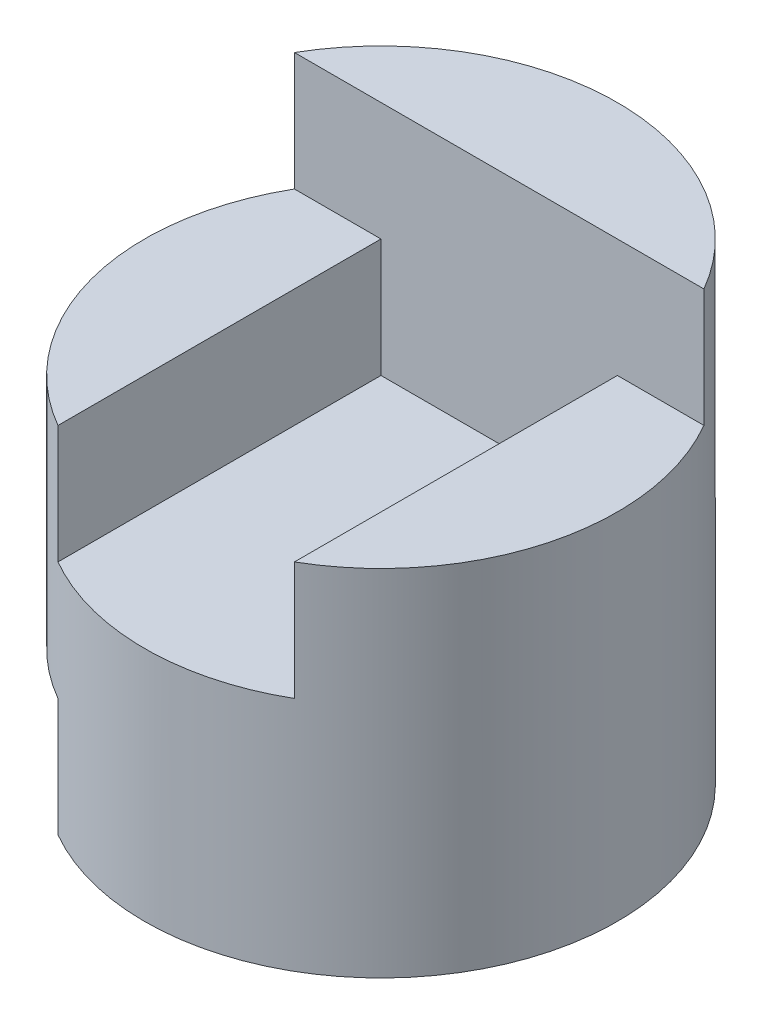
ISO-10303-21;
HEADER;
FILE_DESCRIPTION(('STEP AP214'),'2;1');
FILE_NAME('part.step','',(''),(''),'','','');
FILE_SCHEMA(('AUTOMOTIVE_DESIGN { 1 0 10303 214 1 1 1 1 }'));
ENDSEC;
DATA;
#1=APPLICATION_CONTEXT('core data for automotive mechanical design processes');
#2=APPLICATION_PROTOCOL_DEFINITION('international standard','automotive_design',2000,#1);
#3=PRODUCT_CONTEXT('',#1,'mechanical');
#4=PRODUCT('Part','Part','',(#3));
#5=PRODUCT_RELATED_PRODUCT_CATEGORY('part','',(#4));
#6=PRODUCT_DEFINITION_FORMATION('','',#4);
#7=PRODUCT_DEFINITION_CONTEXT('part definition',#1,'design');
#8=PRODUCT_DEFINITION('design','',#6,#7);
#9=PRODUCT_DEFINITION_SHAPE('','',#8);
#10=(LENGTH_UNIT() NAMED_UNIT(*) SI_UNIT(.MILLI.,.METRE.));
#11=(NAMED_UNIT(*) PLANE_ANGLE_UNIT() SI_UNIT($,.RADIAN.));
#12=(NAMED_UNIT(*) SI_UNIT($,.STERADIAN.) SOLID_ANGLE_UNIT());
#13=UNCERTAINTY_MEASURE_WITH_UNIT(LENGTH_MEASURE(1.E-05),#10,'distance_accuracy_value','');
#14=(GEOMETRIC_REPRESENTATION_CONTEXT(3) GLOBAL_UNCERTAINTY_ASSIGNED_CONTEXT((#13)) GLOBAL_UNIT_ASSIGNED_CONTEXT((#10,
#11,#12)) REPRESENTATION_CONTEXT('',''));
#15=CARTESIAN_POINT('',(0.,0.,0.));
#16=DIRECTION('',(0.,0.,1.));
#17=DIRECTION('',(1.,0.,0.));
#18=AXIS2_PLACEMENT_3D('',#15,#16,#17);
#19=CARTESIAN_POINT('',(0.,4.,0.));
#20=DIRECTION('',(0.,-1.,0.));
#21=DIRECTION('',(0.,0.,-1.));
#22=AXIS2_PLACEMENT_3D('',#19,#20,#21);
#23=CYLINDRICAL_SURFACE('',#22,2.);
#24=CARTESIAN_POINT('',(0.,1.,0.));
#25=DIRECTION('',(0.,-1.,0.));
#26=DIRECTION('',(0.,0.,1.));
#27=AXIS2_PLACEMENT_3D('',#24,#25,#26);
#28=CIRCLE('',#27,2.00000000000001);
#29=CARTESIAN_POINT('',(-1.,1.,1.73205080756888));
#30=VERTEX_POINT('',#29);
#31=CARTESIAN_POINT('',(-1.73205080756888,1.,-1.));
#32=VERTEX_POINT('',#31);
#33=EDGE_CURVE('E110',#30,#32,#28,.T.);
#34=ORIENTED_EDGE('',*,*,#33,.F.);
#35=DIRECTION('',(0.,-1.,0.));
#36=VECTOR('',#35,1.);
#37=CARTESIAN_POINT('',(-1.,1.,1.73205080756888));
#38=LINE('',#37,#36);
#39=CARTESIAN_POINT('',(-1.,0.,1.73205080756888));
#40=VERTEX_POINT('',#39);
#41=EDGE_CURVE('E123',#30,#40,#38,.T.);
#42=ORIENTED_EDGE('',*,*,#41,.T.);
#43=CARTESIAN_POINT('',(0.,0.,0.));
#44=DIRECTION('',(0.,1.,0.));
#45=DIRECTION('',(0.,0.,1.));
#46=AXIS2_PLACEMENT_3D('',#43,#44,#45);
#47=CIRCLE('',#46,2.);
#48=CARTESIAN_POINT('',(-1.73205080756888,0.,-1.));
#49=VERTEX_POINT('',#48);
#50=EDGE_CURVE('E121',#40,#49,#47,.T.);
#51=ORIENTED_EDGE('',*,*,#50,.T.);
#52=DIRECTION('',(0.,-1.,0.));
#53=VECTOR('',#52,1.);
#54=CARTESIAN_POINT('',(-1.73205080756888,1.,-1.));
#55=LINE('',#54,#53);
#56=EDGE_CURVE('E47',#32,#49,#55,.T.);
#57=ORIENTED_EDGE('',*,*,#56,.F.);
#58=EDGE_LOOP('',(#34,#42,#51,#57));
#59=FACE_BOUND('',#58,.T.);
#60=DIRECTION('',(0.,-1.,0.));
#61=VECTOR('',#60,1.);
#62=CARTESIAN_POINT('',(1.73205080756888,4.,-1.));
#63=LINE('',#62,#61);
#64=CARTESIAN_POINT('',(1.73205080756888,4.,-1.));
#65=VERTEX_POINT('',#64);
#66=CARTESIAN_POINT('',(1.73205080756888,3.,-1.));
#67=VERTEX_POINT('',#66);
#68=EDGE_CURVE('E55',#65,#67,#63,.T.);
#69=ORIENTED_EDGE('',*,*,#68,.T.);
#70=CARTESIAN_POINT('',(0.,3.,0.));
#71=DIRECTION('',(0.,1.,0.));
#72=DIRECTION('',(0.,0.,1.));
#73=AXIS2_PLACEMENT_3D('',#70,#71,#72);
#74=CIRCLE('',#73,2.);
#75=CARTESIAN_POINT('',(1.,3.,1.73205080756888));
#76=VERTEX_POINT('',#75);
#77=EDGE_CURVE('E11',#76,#67,#74,.T.);
#78=ORIENTED_EDGE('',*,*,#77,.F.);
#79=DIRECTION('',(0.,-1.,0.));
#80=VECTOR('',#79,1.);
#81=CARTESIAN_POINT('',(1.,4.,1.73205080756888));
#82=LINE('',#81,#80);
#83=CARTESIAN_POINT('',(1.,2.,1.73205080756888));
#84=VERTEX_POINT('',#83);
#85=EDGE_CURVE('E40',#84,#76,#82,.F.);
#86=ORIENTED_EDGE('',*,*,#85,.F.);
#87=CARTESIAN_POINT('',(0.,2.,0.));
#88=DIRECTION('',(0.,1.,0.));
#89=DIRECTION('',(-1.,0.,0.));
#90=AXIS2_PLACEMENT_3D('',#87,#88,#89);
#91=CIRCLE('',#90,2.);
#92=CARTESIAN_POINT('',(-1.,2.,1.73205080756888));
#93=VERTEX_POINT('',#92);
#94=EDGE_CURVE('E164',#93,#84,#91,.T.);
#95=ORIENTED_EDGE('',*,*,#94,.F.);
#96=DIRECTION('',(0.,-1.,0.));
#97=VECTOR('',#96,1.);
#98=CARTESIAN_POINT('',(-1.,4.,1.73205080756888));
#99=LINE('',#98,#97);
#100=CARTESIAN_POINT('',(-1.,3.,1.73205080756888));
#101=VERTEX_POINT('',#100);
#102=EDGE_CURVE('E162',#101,#93,#99,.T.);
#103=ORIENTED_EDGE('',*,*,#102,.F.);
#104=CARTESIAN_POINT('',(0.,3.,0.));
#105=DIRECTION('',(0.,1.,0.));
#106=DIRECTION('',(-1.,0.,0.));
#107=AXIS2_PLACEMENT_3D('',#104,#105,#106);
#108=CIRCLE('',#107,2.);
#109=CARTESIAN_POINT('',(-1.73205080756888,3.,-1.));
#110=VERTEX_POINT('',#109);
#111=EDGE_CURVE('E160',#110,#101,#108,.T.);
#112=ORIENTED_EDGE('',*,*,#111,.F.);
#113=DIRECTION('',(0.,-1.,0.));
#114=VECTOR('',#113,1.);
#115=CARTESIAN_POINT('',(-1.73205080756888,4.,-1.));
#116=LINE('',#115,#114);
#117=CARTESIAN_POINT('',(-1.73205080756888,4.,-1.));
#118=VERTEX_POINT('',#117);
#119=EDGE_CURVE('E150',#110,#118,#116,.F.);
#120=ORIENTED_EDGE('',*,*,#119,.T.);
#121=CARTESIAN_POINT('',(0.,4.,0.));
#122=DIRECTION('',(0.,1.,0.));
#123=DIRECTION('',(0.,0.,1.));
#124=AXIS2_PLACEMENT_3D('',#121,#122,#123);
#125=CIRCLE('',#124,2.);
#126=EDGE_CURVE('E154',#65,#118,#125,.T.);
#127=ORIENTED_EDGE('',*,*,#126,.F.);
#128=EDGE_LOOP('',(#69,#78,#86,#95,#103,#112,#120,#127));
#129=FACE_BOUND('',#128,.T.);
#130=ADVANCED_FACE('F33',(#59,#129),#23,.T.);
#131=CARTESIAN_POINT('',(0.,4.,0.));
#132=DIRECTION('',(0.,1.,0.));
#133=DIRECTION('',(0.,0.,1.));
#134=AXIS2_PLACEMENT_3D('',#131,#132,#133);
#135=PLANE('',#134);
#136=DIRECTION('',(-1.,0.,0.));
#137=VECTOR('',#136,1.);
#138=CARTESIAN_POINT('',(0.,4.,-1.));
#139=LINE('',#138,#137);
#140=EDGE_CURVE('E157',#65,#118,#139,.T.);
#141=ORIENTED_EDGE('',*,*,#140,.F.);
#142=ORIENTED_EDGE('',*,*,#126,.T.);
#143=EDGE_LOOP('',(#141,#142));
#144=FACE_BOUND('',#143,.T.);
#145=ADVANCED_FACE('F179',(#144),#135,.T.);
#146=CARTESIAN_POINT('',(0.,0.,0.));
#147=DIRECTION('',(0.,1.,0.));
#148=DIRECTION('',(0.,0.,1.));
#149=AXIS2_PLACEMENT_3D('',#146,#147,#148);
#150=PLANE('',#149);
#151=ORIENTED_EDGE('',*,*,#50,.F.);
#152=DIRECTION('',(0.,0.,1.));
#153=VECTOR('',#152,1.);
#154=CARTESIAN_POINT('',(-1.,0.,1.73205080756888));
#155=LINE('',#154,#153);
#156=CARTESIAN_POINT('',(-1.,0.,-1.));
#157=VERTEX_POINT('',#156);
#158=EDGE_CURVE('E116',#157,#40,#155,.T.);
#159=ORIENTED_EDGE('',*,*,#158,.F.);
#160=DIRECTION('',(1.,0.,0.));
#161=VECTOR('',#160,1.);
#162=CARTESIAN_POINT('',(-1.,0.,-1.));
#163=LINE('',#162,#161);
#164=EDGE_CURVE('E287',#49,#157,#163,.T.);
#165=ORIENTED_EDGE('',*,*,#164,.F.);
#166=EDGE_LOOP('',(#151,#159,#165));
#167=FACE_BOUND('',#166,.T.);
#168=ADVANCED_FACE('F205',(#167),#150,.F.);
#169=CARTESIAN_POINT('',(-1.,3.,3.));
#170=DIRECTION('',(0.,1.,0.));
#171=DIRECTION('',(-1.,0.,0.));
#172=AXIS2_PLACEMENT_3D('',#169,#170,#171);
#173=PLANE('',#172);
#174=ORIENTED_EDGE('',*,*,#111,.T.);
#175=DIRECTION('',(0.,0.,-1.));
#176=VECTOR('',#175,1.);
#177=CARTESIAN_POINT('',(-1.,3.,3.));
#178=LINE('',#177,#176);
#179=CARTESIAN_POINT('',(-1.,3.,-1.));
#180=VERTEX_POINT('',#179);
#181=EDGE_CURVE('E148',#101,#180,#178,.T.);
#182=ORIENTED_EDGE('',*,*,#181,.T.);
#183=DIRECTION('',(1.,0.,0.));
#184=VECTOR('',#183,1.);
#185=CARTESIAN_POINT('',(-1.,3.,-1.));
#186=LINE('',#185,#184);
#187=EDGE_CURVE('E128',#110,#180,#186,.T.);
#188=ORIENTED_EDGE('',*,*,#187,.F.);
#189=EDGE_LOOP('',(#174,#182,#188));
#190=FACE_BOUND('',#189,.T.);
#191=ADVANCED_FACE('F184',(#190),#173,.T.);
#192=CARTESIAN_POINT('',(-1.,2.,3.));
#193=DIRECTION('',(1.,0.,0.));
#194=DIRECTION('',(0.,0.,-1.));
#195=AXIS2_PLACEMENT_3D('',#192,#193,#194);
#196=PLANE('',#195);
#197=ORIENTED_EDGE('',*,*,#102,.T.);
#198=DIRECTION('',(0.,0.,-1.));
#199=VECTOR('',#198,1.);
#200=CARTESIAN_POINT('',(-1.,2.,3.));
#201=LINE('',#200,#199);
#202=CARTESIAN_POINT('',(-1.,2.,-1.));
#203=VERTEX_POINT('',#202);
#204=EDGE_CURVE('E146',#93,#203,#201,.T.);
#205=ORIENTED_EDGE('',*,*,#204,.T.);
#206=DIRECTION('',(0.,-1.,0.));
#207=VECTOR('',#206,1.);
#208=CARTESIAN_POINT('',(-1.,2.,-1.));
#209=LINE('',#208,#207);
#210=EDGE_CURVE('E131',#180,#203,#209,.T.);
#211=ORIENTED_EDGE('',*,*,#210,.F.);
#212=ORIENTED_EDGE('',*,*,#181,.F.);
#213=EDGE_LOOP('',(#197,#205,#211,#212));
#214=FACE_BOUND('',#213,.T.);
#215=ADVANCED_FACE('F189',(#214),#196,.T.);
#216=CARTESIAN_POINT('',(1.,2.,3.));
#217=DIRECTION('',(0.,1.,0.));
#218=DIRECTION('',(-1.,0.,0.));
#219=AXIS2_PLACEMENT_3D('',#216,#217,#218);
#220=PLANE('',#219);
#221=ORIENTED_EDGE('',*,*,#94,.T.);
#222=DIRECTION('',(0.,0.,-1.));
#223=VECTOR('',#222,1.);
#224=CARTESIAN_POINT('',(1.,2.,3.));
#225=LINE('',#224,#223);
#226=CARTESIAN_POINT('',(1.,2.,-1.));
#227=VERTEX_POINT('',#226);
#228=EDGE_CURVE('E144',#84,#227,#225,.T.);
#229=ORIENTED_EDGE('',*,*,#228,.T.);
#230=DIRECTION('',(1.,0.,0.));
#231=VECTOR('',#230,1.);
#232=CARTESIAN_POINT('',(1.,2.,-1.));
#233=LINE('',#232,#231);
#234=EDGE_CURVE('E134',#203,#227,#233,.T.);
#235=ORIENTED_EDGE('',*,*,#234,.F.);
#236=ORIENTED_EDGE('',*,*,#204,.F.);
#237=EDGE_LOOP('',(#221,#229,#235,#236));
#238=FACE_BOUND('',#237,.T.);
#239=ADVANCED_FACE('F192',(#238),#220,.T.);
#240=CARTESIAN_POINT('',(1.,3.,3.));
#241=DIRECTION('',(-1.,0.,0.));
#242=DIRECTION('',(0.,-1.,0.));
#243=AXIS2_PLACEMENT_3D('',#240,#241,#242);
#244=PLANE('',#243);
#245=ORIENTED_EDGE('',*,*,#85,.T.);
#246=DIRECTION('',(0.,0.,-1.));
#247=VECTOR('',#246,1.);
#248=CARTESIAN_POINT('',(1.,3.,3.));
#249=LINE('',#248,#247);
#250=CARTESIAN_POINT('',(1.,3.,-1.));
#251=VERTEX_POINT('',#250);
#252=EDGE_CURVE('E142',#76,#251,#249,.T.);
#253=ORIENTED_EDGE('',*,*,#252,.T.);
#254=DIRECTION('',(0.,1.,0.));
#255=VECTOR('',#254,1.);
#256=CARTESIAN_POINT('',(1.,3.,-1.));
#257=LINE('',#256,#255);
#258=EDGE_CURVE('E137',#227,#251,#257,.T.);
#259=ORIENTED_EDGE('',*,*,#258,.F.);
#260=ORIENTED_EDGE('',*,*,#228,.F.);
#261=EDGE_LOOP('',(#245,#253,#259,#260));
#262=FACE_BOUND('',#261,.T.);
#263=ADVANCED_FACE('F169',(#262),#244,.T.);
#264=CARTESIAN_POINT('',(2.,3.,3.));
#265=DIRECTION('',(0.,1.,0.));
#266=DIRECTION('',(0.,0.,1.));
#267=AXIS2_PLACEMENT_3D('',#264,#265,#266);
#268=PLANE('',#267);
#269=ORIENTED_EDGE('',*,*,#77,.T.);
#270=DIRECTION('',(1.,0.,0.));
#271=VECTOR('',#270,1.);
#272=CARTESIAN_POINT('',(2.,3.,-1.));
#273=LINE('',#272,#271);
#274=EDGE_CURVE('E140',#251,#67,#273,.T.);
#275=ORIENTED_EDGE('',*,*,#274,.F.);
#276=ORIENTED_EDGE('',*,*,#252,.F.);
#277=EDGE_LOOP('',(#269,#275,#276));
#278=FACE_BOUND('',#277,.T.);
#279=ADVANCED_FACE('F175',(#278),#268,.T.);
#280=CARTESIAN_POINT('',(0.,0.,-1.));
#281=DIRECTION('',(0.,0.,-1.));
#282=DIRECTION('',(-1.,0.,0.));
#283=AXIS2_PLACEMENT_3D('',#280,#281,#282);
#284=PLANE('',#283);
#285=ORIENTED_EDGE('',*,*,#140,.T.);
#286=ORIENTED_EDGE('',*,*,#119,.F.);
#287=ORIENTED_EDGE('',*,*,#187,.T.);
#288=ORIENTED_EDGE('',*,*,#210,.T.);
#289=ORIENTED_EDGE('',*,*,#234,.T.);
#290=ORIENTED_EDGE('',*,*,#258,.T.);
#291=ORIENTED_EDGE('',*,*,#274,.T.);
#292=ORIENTED_EDGE('',*,*,#68,.F.);
#293=EDGE_LOOP('',(#285,#286,#287,#288,#289,#290,#291,#292));
#294=FACE_BOUND('',#293,.T.);
#295=ADVANCED_FACE('F180',(#294),#284,.F.);
#296=CARTESIAN_POINT('',(-1.,1.,1.73205080756888));
#297=DIRECTION('',(1.,0.,0.));
#298=DIRECTION('',(0.,0.,-1.));
#299=AXIS2_PLACEMENT_3D('',#296,#297,#298);
#300=PLANE('',#299);
#301=ORIENTED_EDGE('',*,*,#158,.T.);
#302=ORIENTED_EDGE('',*,*,#41,.F.);
#303=DIRECTION('',(0.,0.,1.));
#304=VECTOR('',#303,1.);
#305=CARTESIAN_POINT('',(-1.,1.,1.73205080756888));
#306=LINE('',#305,#304);
#307=CARTESIAN_POINT('',(-1.,1.,-1.));
#308=VERTEX_POINT('',#307);
#309=EDGE_CURVE('E109',#308,#30,#306,.T.);
#310=ORIENTED_EDGE('',*,*,#309,.F.);
#311=DIRECTION('',(0.,-1.,0.));
#312=VECTOR('',#311,1.);
#313=CARTESIAN_POINT('',(-1.,1.,-1.));
#314=LINE('',#313,#312);
#315=EDGE_CURVE('E105',#308,#157,#314,.T.);
#316=ORIENTED_EDGE('',*,*,#315,.T.);
#317=EDGE_LOOP('',(#301,#302,#310,#316));
#318=FACE_BOUND('',#317,.T.);
#319=ADVANCED_FACE('F247',(#318),#300,.F.);
#320=CARTESIAN_POINT('',(-1.,1.,-1.));
#321=DIRECTION('',(0.,0.,-1.));
#322=DIRECTION('',(-1.,0.,0.));
#323=AXIS2_PLACEMENT_3D('',#320,#321,#322);
#324=PLANE('',#323);
#325=ORIENTED_EDGE('',*,*,#164,.T.);
#326=ORIENTED_EDGE('',*,*,#315,.F.);
#327=DIRECTION('',(1.,0.,0.));
#328=VECTOR('',#327,1.);
#329=CARTESIAN_POINT('',(-1.,1.,-1.));
#330=LINE('',#329,#328);
#331=EDGE_CURVE('E102',#32,#308,#330,.T.);
#332=ORIENTED_EDGE('',*,*,#331,.F.);
#333=ORIENTED_EDGE('',*,*,#56,.T.);
#334=EDGE_LOOP('',(#325,#326,#332,#333));
#335=FACE_BOUND('',#334,.T.);
#336=ADVANCED_FACE('F104',(#335),#324,.F.);
#337=CARTESIAN_POINT('',(0.,1.,0.));
#338=DIRECTION('',(0.,1.,0.));
#339=DIRECTION('',(0.,0.,1.));
#340=AXIS2_PLACEMENT_3D('',#337,#338,#339);
#341=PLANE('',#340);
#342=ORIENTED_EDGE('',*,*,#33,.T.);
#343=ORIENTED_EDGE('',*,*,#331,.T.);
#344=ORIENTED_EDGE('',*,*,#309,.T.);
#345=EDGE_LOOP('',(#342,#343,#344));
#346=FACE_BOUND('',#345,.T.);
#347=ADVANCED_FACE('F113',(#346),#341,.F.);
#348=CLOSED_SHELL('',(#130,#145,#168,#191,#215,#239,#263,#279,#295,#319,#336,#347));
#349=MANIFOLD_SOLID_BREP('B2',#348);
#350=ADVANCED_BREP_SHAPE_REPRESENTATION('',(#18,#349),#14);
#351=SHAPE_DEFINITION_REPRESENTATION(#9,#350);
ENDSEC;
END-ISO-10303-21;
